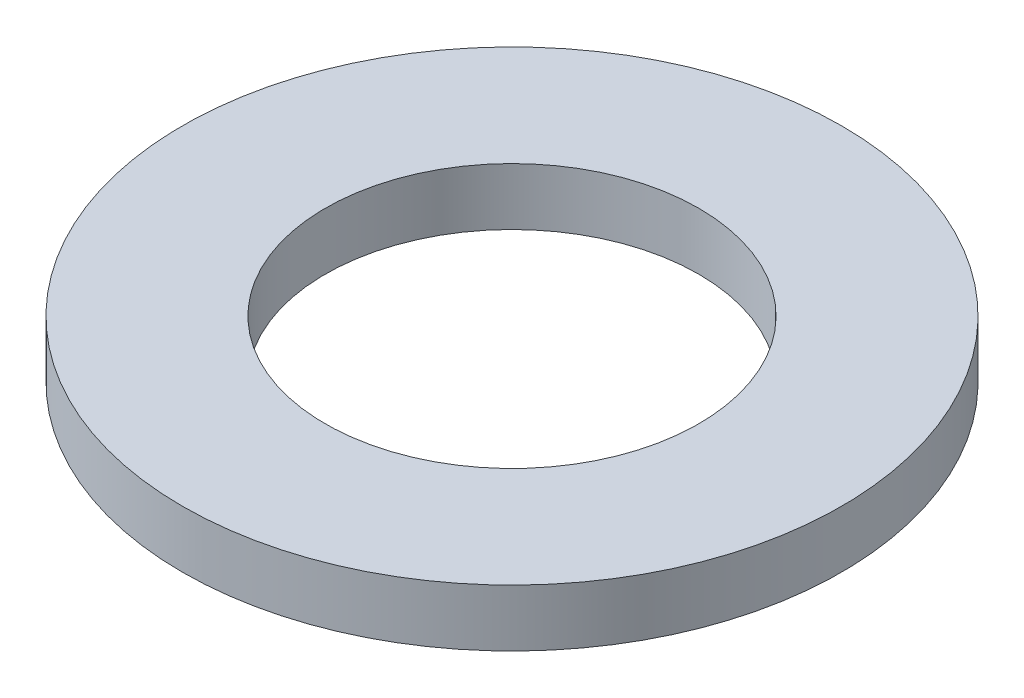
ISO-10303-21;
HEADER;
FILE_DESCRIPTION(('STEP AP214'),'2;1');
FILE_NAME('part.step','',(''),(''),'','','');
FILE_SCHEMA(('AUTOMOTIVE_DESIGN { 1 0 10303 214 1 1 1 1 }'));
ENDSEC;
DATA;
#1=APPLICATION_CONTEXT('core data for automotive mechanical design processes');
#2=APPLICATION_PROTOCOL_DEFINITION('international standard','automotive_design',2000,#1);
#3=PRODUCT_CONTEXT('',#1,'mechanical');
#4=PRODUCT('Part','Part','',(#3));
#5=PRODUCT_RELATED_PRODUCT_CATEGORY('part','',(#4));
#6=PRODUCT_DEFINITION_FORMATION('','',#4);
#7=PRODUCT_DEFINITION_CONTEXT('part definition',#1,'design');
#8=PRODUCT_DEFINITION('design','',#6,#7);
#9=PRODUCT_DEFINITION_SHAPE('','',#8);
#10=(LENGTH_UNIT() NAMED_UNIT(*) SI_UNIT(.MILLI.,.METRE.));
#11=(NAMED_UNIT(*) PLANE_ANGLE_UNIT() SI_UNIT($,.RADIAN.));
#12=(NAMED_UNIT(*) SI_UNIT($,.STERADIAN.) SOLID_ANGLE_UNIT());
#13=UNCERTAINTY_MEASURE_WITH_UNIT(LENGTH_MEASURE(1.E-05),#10,'distance_accuracy_value','');
#14=(GEOMETRIC_REPRESENTATION_CONTEXT(3) GLOBAL_UNCERTAINTY_ASSIGNED_CONTEXT((#13)) GLOBAL_UNIT_ASSIGNED_CONTEXT((#10,
#11,#12)) REPRESENTATION_CONTEXT('',''));
#15=CARTESIAN_POINT('',(0.,0.,0.));
#16=DIRECTION('',(0.,0.,1.));
#17=DIRECTION('',(1.,0.,0.));
#18=AXIS2_PLACEMENT_3D('',#15,#16,#17);
#19=CARTESIAN_POINT('',(0.,13.,0.));
#20=DIRECTION('',(0.,-1.,0.));
#21=DIRECTION('',(0.,0.,-1.));
#22=AXIS2_PLACEMENT_3D('',#19,#20,#21);
#23=CYLINDRICAL_SURFACE('',#22,75.);
#24=CARTESIAN_POINT('',(0.,13.,0.));
#25=DIRECTION('',(0.,1.,0.));
#26=DIRECTION('',(0.,0.,1.));
#27=AXIS2_PLACEMENT_3D('',#24,#25,#26);
#28=CIRCLE('',#27,75.);
#29=CARTESIAN_POINT('',(0.,13.,-75.));
#30=VERTEX_POINT('',#29);
#31=EDGE_CURVE('E10',#30,#30,#28,.T.);
#32=CARTESIAN_POINT('',(0.,0.,0.));
#33=DIRECTION('',(0.,1.,0.));
#34=DIRECTION('',(0.,0.,1.));
#35=AXIS2_PLACEMENT_3D('',#32,#33,#34);
#36=CIRCLE('',#35,75.);
#37=CARTESIAN_POINT('',(0.,0.,-75.));
#38=VERTEX_POINT('',#37);
#39=EDGE_CURVE('E37',#38,#38,#36,.T.);
#40=CARTESIAN_POINT('',(0.,13.,-75.));
#41=CARTESIAN_POINT('',(0.,12.8645833333333,-75.));
#42=CARTESIAN_POINT('',(0.,12.7291666666667,-75.));
#43=CARTESIAN_POINT('',(0.,12.4583333333333,-75.));
#44=CARTESIAN_POINT('',(0.,12.3229166666667,-75.));
#45=CARTESIAN_POINT('',(0.,12.0520833333333,-75.));
#46=CARTESIAN_POINT('',(0.,11.9166666666667,-75.));
#47=CARTESIAN_POINT('',(0.,11.6458333333333,-75.));
#48=CARTESIAN_POINT('',(0.,11.5104166666667,-75.));
#49=CARTESIAN_POINT('',(0.,11.2395833333333,-75.));
#50=CARTESIAN_POINT('',(0.,11.1041666666667,-75.));
#51=CARTESIAN_POINT('',(0.,10.8333333333333,-75.));
#52=CARTESIAN_POINT('',(0.,10.6979166666667,-75.));
#53=CARTESIAN_POINT('',(0.,10.4270833333333,-75.));
#54=CARTESIAN_POINT('',(0.,10.2916666666667,-75.));
#55=CARTESIAN_POINT('',(0.,10.0208333333333,-75.));
#56=CARTESIAN_POINT('',(0.,9.88541666666667,-75.));
#57=CARTESIAN_POINT('',(0.,9.61458333333333,-75.));
#58=CARTESIAN_POINT('',(0.,9.47916666666667,-75.));
#59=CARTESIAN_POINT('',(0.,9.20833333333333,-75.));
#60=CARTESIAN_POINT('',(0.,9.07291666666666,-75.));
#61=CARTESIAN_POINT('',(0.,8.80208333333333,-75.));
#62=CARTESIAN_POINT('',(0.,8.66666666666667,-75.));
#63=CARTESIAN_POINT('',(0.,8.39583333333333,-75.));
#64=CARTESIAN_POINT('',(0.,8.26041666666667,-75.));
#65=CARTESIAN_POINT('',(0.,7.98958333333333,-75.));
#66=CARTESIAN_POINT('',(0.,7.85416666666667,-75.));
#67=CARTESIAN_POINT('',(0.,7.58333333333333,-75.));
#68=CARTESIAN_POINT('',(0.,7.44791666666667,-75.));
#69=CARTESIAN_POINT('',(0.,7.17708333333333,-75.));
#70=CARTESIAN_POINT('',(0.,7.04166666666667,-75.));
#71=CARTESIAN_POINT('',(0.,6.77083333333333,-75.));
#72=CARTESIAN_POINT('',(0.,6.63541666666667,-75.));
#73=CARTESIAN_POINT('',(0.,6.36458333333333,-75.));
#74=CARTESIAN_POINT('',(0.,6.22916666666667,-75.));
#75=CARTESIAN_POINT('',(0.,5.95833333333333,-75.));
#76=CARTESIAN_POINT('',(0.,5.82291666666667,-75.));
#77=CARTESIAN_POINT('',(0.,5.55208333333333,-75.));
#78=CARTESIAN_POINT('',(0.,5.41666666666667,-75.));
#79=CARTESIAN_POINT('',(0.,5.14583333333333,-75.));
#80=CARTESIAN_POINT('',(0.,5.01041666666667,-75.));
#81=CARTESIAN_POINT('',(0.,4.73958333333333,-75.));
#82=CARTESIAN_POINT('',(0.,4.60416666666667,-75.));
#83=CARTESIAN_POINT('',(0.,4.33333333333333,-75.));
#84=CARTESIAN_POINT('',(0.,4.19791666666667,-75.));
#85=CARTESIAN_POINT('',(0.,3.92708333333333,-75.));
#86=CARTESIAN_POINT('',(0.,3.79166666666667,-75.));
#87=CARTESIAN_POINT('',(0.,3.52083333333333,-75.));
#88=CARTESIAN_POINT('',(0.,3.38541666666667,-75.));
#89=CARTESIAN_POINT('',(0.,3.11458333333333,-75.));
#90=CARTESIAN_POINT('',(0.,2.97916666666667,-75.));
#91=CARTESIAN_POINT('',(0.,2.70833333333333,-75.));
#92=CARTESIAN_POINT('',(0.,2.57291666666667,-75.));
#93=CARTESIAN_POINT('',(0.,2.30208333333333,-75.));
#94=CARTESIAN_POINT('',(0.,2.16666666666667,-75.));
#95=CARTESIAN_POINT('',(0.,1.89583333333333,-75.));
#96=CARTESIAN_POINT('',(0.,1.76041666666667,-75.));
#97=CARTESIAN_POINT('',(0.,1.48958333333333,-75.));
#98=CARTESIAN_POINT('',(0.,1.35416666666667,-75.));
#99=CARTESIAN_POINT('',(0.,1.08333333333333,-75.));
#100=CARTESIAN_POINT('',(0.,0.947916666666667,-75.));
#101=CARTESIAN_POINT('',(0.,0.677083333333334,-75.));
#102=CARTESIAN_POINT('',(0.,0.541666666666667,-75.));
#103=CARTESIAN_POINT('',(0.,0.270833333333334,-75.));
#104=CARTESIAN_POINT('',(0.,0.135416666666667,-75.));
#105=CARTESIAN_POINT('',(0.,0.,-75.));
#106=B_SPLINE_CURVE_WITH_KNOTS('',3,(#40,#41,#42,#43,#44,#45,#46,#47,#48,#49,#50,#51,#52,#53,
#54,#55,#56,#57,#58,#59,#60,#61,#62,#63,#64,#65,#66,#67,#68,#69,#70,#71,#72,#73,#74,#75,#76,#77,
#78,#79,#80,#81,#82,#83,#84,#85,#86,#87,#88,#89,#90,#91,#92,#93,#94,#95,#96,#97,#98,#99,#100,
#101,#102,#103,#104,#105),.UNSPECIFIED.,.F.,.F.,(4,2,2,2,2,2,2,2,2,2,2,2,2,2,2,2,2,2,2,2,2,2,2,
2,2,2,2,2,2,2,2,2,4),(0.,0.40625,0.812500000000001,1.21875,1.625,2.03125,2.4375,2.84375,3.25,
3.65625,4.0625,4.46875,4.875,5.28125,5.6875,6.09375,6.5,6.90625,7.3125,7.71875,8.125,8.53125,
8.9375,9.34375,9.75,10.15625,10.5625,10.96875,11.375,11.78125,12.1875,12.59375,13.),.UNSPECIFIED.);
#107=EDGE_CURVE('BSEAM40',#30,#38,#106,.T.);
#108=ORIENTED_EDGE('',*,*,#31,.F.);
#109=ORIENTED_EDGE('',*,*,#39,.T.);
#110=ORIENTED_EDGE('',*,*,#107,.T.);
#111=ORIENTED_EDGE('',*,*,#107,.F.);
#112=EDGE_LOOP('',(#108,#110,#109,#111));
#113=FACE_BOUND('',#112,.T.);
#114=ADVANCED_FACE('F40',(#113),#23,.T.);
#115=CARTESIAN_POINT('',(0.,13.,0.));
#116=DIRECTION('',(0.,1.,0.));
#117=DIRECTION('',(0.,0.,1.));
#118=AXIS2_PLACEMENT_3D('',#115,#116,#117);
#119=PLANE('',#118);
#120=CARTESIAN_POINT('',(0.,13.,0.));
#121=DIRECTION('',(0.,1.,0.));
#122=DIRECTION('',(0.,0.,1.));
#123=AXIS2_PLACEMENT_3D('',#120,#121,#122);
#124=CIRCLE('',#123,42.5);
#125=CARTESIAN_POINT('',(0.,13.,-42.5));
#126=VERTEX_POINT('',#125);
#127=EDGE_CURVE('E50',#126,#126,#124,.T.);
#128=ORIENTED_EDGE('',*,*,#127,.F.);
#129=EDGE_LOOP('',(#128));
#130=FACE_BOUND('',#129,.T.);
#131=ORIENTED_EDGE('',*,*,#31,.T.);
#132=EDGE_LOOP('',(#131));
#133=FACE_BOUND('',#132,.T.);
#134=ADVANCED_FACE('F59',(#130,#133),#119,.T.);
#135=CARTESIAN_POINT('',(0.,0.,0.));
#136=DIRECTION('',(0.,1.,0.));
#137=DIRECTION('',(0.,0.,1.));
#138=AXIS2_PLACEMENT_3D('',#135,#136,#137);
#139=PLANE('',#138);
#140=CARTESIAN_POINT('',(0.,0.,0.));
#141=DIRECTION('',(0.,1.,0.));
#142=DIRECTION('',(0.,0.,1.));
#143=AXIS2_PLACEMENT_3D('',#140,#141,#142);
#144=CIRCLE('',#143,42.5);
#145=CARTESIAN_POINT('',(0.,0.,-42.5));
#146=VERTEX_POINT('',#145);
#147=EDGE_CURVE('E47',#146,#146,#144,.T.);
#148=ORIENTED_EDGE('',*,*,#147,.T.);
#149=EDGE_LOOP('',(#148));
#150=FACE_BOUND('',#149,.T.);
#151=ORIENTED_EDGE('',*,*,#39,.F.);
#152=EDGE_LOOP('',(#151));
#153=FACE_BOUND('',#152,.T.);
#154=ADVANCED_FACE('F58',(#150,#153),#139,.F.);
#155=CARTESIAN_POINT('',(0.,13.,0.));
#156=DIRECTION('',(0.,-1.,0.));
#157=DIRECTION('',(0.,0.,-1.));
#158=AXIS2_PLACEMENT_3D('',#155,#156,#157);
#159=CYLINDRICAL_SURFACE('',#158,42.5);
#160=CARTESIAN_POINT('',(0.,13.,-42.5));
#161=CARTESIAN_POINT('',(0.,12.8645833333333,-42.5));
#162=CARTESIAN_POINT('',(0.,12.7291666666667,-42.5));
#163=CARTESIAN_POINT('',(0.,12.4583333333333,-42.5));
#164=CARTESIAN_POINT('',(0.,12.3229166666667,-42.5));
#165=CARTESIAN_POINT('',(0.,12.0520833333333,-42.5));
#166=CARTESIAN_POINT('',(0.,11.9166666666667,-42.5));
#167=CARTESIAN_POINT('',(0.,11.6458333333333,-42.5));
#168=CARTESIAN_POINT('',(0.,11.5104166666667,-42.5));
#169=CARTESIAN_POINT('',(0.,11.2395833333333,-42.5));
#170=CARTESIAN_POINT('',(0.,11.1041666666667,-42.5));
#171=CARTESIAN_POINT('',(0.,10.8333333333333,-42.5));
#172=CARTESIAN_POINT('',(0.,10.6979166666667,-42.5));
#173=CARTESIAN_POINT('',(0.,10.4270833333333,-42.5));
#174=CARTESIAN_POINT('',(0.,10.2916666666667,-42.5));
#175=CARTESIAN_POINT('',(0.,10.0208333333333,-42.5));
#176=CARTESIAN_POINT('',(0.,9.88541666666667,-42.5));
#177=CARTESIAN_POINT('',(0.,9.61458333333333,-42.5));
#178=CARTESIAN_POINT('',(0.,9.47916666666667,-42.5));
#179=CARTESIAN_POINT('',(0.,9.20833333333333,-42.5));
#180=CARTESIAN_POINT('',(0.,9.07291666666666,-42.5));
#181=CARTESIAN_POINT('',(0.,8.80208333333333,-42.5));
#182=CARTESIAN_POINT('',(0.,8.66666666666667,-42.5));
#183=CARTESIAN_POINT('',(0.,8.39583333333333,-42.5));
#184=CARTESIAN_POINT('',(0.,8.26041666666667,-42.5));
#185=CARTESIAN_POINT('',(0.,7.98958333333333,-42.5));
#186=CARTESIAN_POINT('',(0.,7.85416666666667,-42.5));
#187=CARTESIAN_POINT('',(0.,7.58333333333333,-42.5));
#188=CARTESIAN_POINT('',(0.,7.44791666666667,-42.5));
#189=CARTESIAN_POINT('',(0.,7.17708333333333,-42.5));
#190=CARTESIAN_POINT('',(0.,7.04166666666667,-42.5));
#191=CARTESIAN_POINT('',(0.,6.77083333333333,-42.5));
#192=CARTESIAN_POINT('',(0.,6.63541666666667,-42.5));
#193=CARTESIAN_POINT('',(0.,6.36458333333333,-42.5));
#194=CARTESIAN_POINT('',(0.,6.22916666666667,-42.5));
#195=CARTESIAN_POINT('',(0.,5.95833333333333,-42.5));
#196=CARTESIAN_POINT('',(0.,5.82291666666667,-42.5));
#197=CARTESIAN_POINT('',(0.,5.55208333333333,-42.5));
#198=CARTESIAN_POINT('',(0.,5.41666666666667,-42.5));
#199=CARTESIAN_POINT('',(0.,5.14583333333333,-42.5));
#200=CARTESIAN_POINT('',(0.,5.01041666666667,-42.5));
#201=CARTESIAN_POINT('',(0.,4.73958333333333,-42.5));
#202=CARTESIAN_POINT('',(0.,4.60416666666667,-42.5));
#203=CARTESIAN_POINT('',(0.,4.33333333333333,-42.5));
#204=CARTESIAN_POINT('',(0.,4.19791666666667,-42.5));
#205=CARTESIAN_POINT('',(0.,3.92708333333333,-42.5));
#206=CARTESIAN_POINT('',(0.,3.79166666666667,-42.5));
#207=CARTESIAN_POINT('',(0.,3.52083333333333,-42.5));
#208=CARTESIAN_POINT('',(0.,3.38541666666667,-42.5));
#209=CARTESIAN_POINT('',(0.,3.11458333333333,-42.5));
#210=CARTESIAN_POINT('',(0.,2.97916666666667,-42.5));
#211=CARTESIAN_POINT('',(0.,2.70833333333333,-42.5));
#212=CARTESIAN_POINT('',(0.,2.57291666666667,-42.5));
#213=CARTESIAN_POINT('',(0.,2.30208333333333,-42.5));
#214=CARTESIAN_POINT('',(0.,2.16666666666667,-42.5));
#215=CARTESIAN_POINT('',(0.,1.89583333333333,-42.5));
#216=CARTESIAN_POINT('',(0.,1.76041666666667,-42.5));
#217=CARTESIAN_POINT('',(0.,1.48958333333333,-42.5));
#218=CARTESIAN_POINT('',(0.,1.35416666666667,-42.5));
#219=CARTESIAN_POINT('',(0.,1.08333333333333,-42.5));
#220=CARTESIAN_POINT('',(0.,0.947916666666667,-42.5));
#221=CARTESIAN_POINT('',(0.,0.677083333333334,-42.5));
#222=CARTESIAN_POINT('',(0.,0.541666666666667,-42.5));
#223=CARTESIAN_POINT('',(0.,0.270833333333334,-42.5));
#224=CARTESIAN_POINT('',(0.,0.135416666666667,-42.5));
#225=CARTESIAN_POINT('',(0.,0.,-42.5));
#226=B_SPLINE_CURVE_WITH_KNOTS('',3,(#160,#161,#162,#163,#164,#165,#166,#167,#168,#169,#170,
#171,#172,#173,#174,#175,#176,#177,#178,#179,#180,#181,#182,#183,#184,#185,#186,#187,#188,#189,
#190,#191,#192,#193,#194,#195,#196,#197,#198,#199,#200,#201,#202,#203,#204,#205,#206,#207,#208,
#209,#210,#211,#212,#213,#214,#215,#216,#217,#218,#219,#220,#221,#222,#223,#224,#225),
.UNSPECIFIED.,.F.,.F.,(4,2,2,2,2,2,2,2,2,2,2,2,2,2,2,2,2,2,2,2,2,2,2,2,2,2,2,2,2,2,2,2,4),(0.,
0.40625,0.812500000000001,1.21875,1.625,2.03125,2.4375,2.84375,3.25,3.65625,4.0625,4.46875,
4.875,5.28125,5.6875,6.09375,6.5,6.90625,7.3125,7.71875,8.125,8.53125,8.9375,9.34375,9.75,
10.15625,10.5625,10.96875,11.375,11.78125,12.1875,12.59375,13.),.UNSPECIFIED.);
#227=EDGE_CURVE('BSEAM54',#126,#146,#226,.T.);
#228=ORIENTED_EDGE('',*,*,#127,.T.);
#229=ORIENTED_EDGE('',*,*,#147,.F.);
#230=ORIENTED_EDGE('',*,*,#227,.T.);
#231=ORIENTED_EDGE('',*,*,#227,.F.);
#232=EDGE_LOOP('',(#228,#230,#229,#231));
#233=FACE_BOUND('',#232,.T.);
#234=ADVANCED_FACE('F54',(#233),#159,.F.);
#235=CLOSED_SHELL('',(#114,#134,#154,#234));
#236=MANIFOLD_SOLID_BREP('B2',#235);
#237=ADVANCED_BREP_SHAPE_REPRESENTATION('',(#18,#236),#14);
#238=SHAPE_DEFINITION_REPRESENTATION(#9,#237);
ENDSEC;
END-ISO-10303-21;
